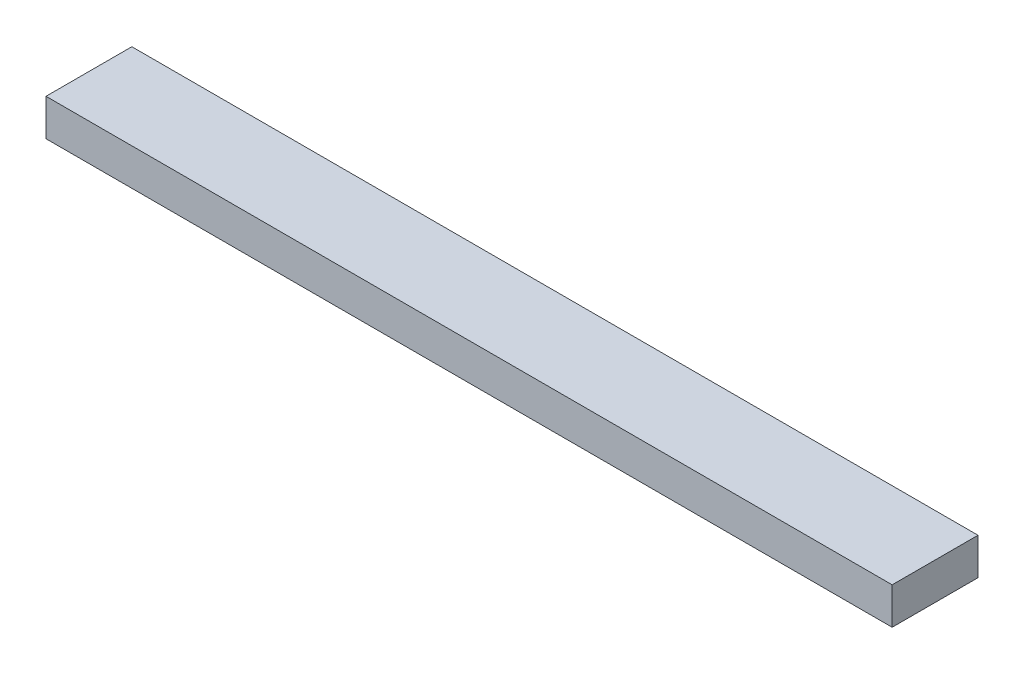
ISO-10303-21;
HEADER;
FILE_DESCRIPTION(('STEP AP214'),'2;1');
FILE_NAME('part.step','',(''),(''),'','','');
FILE_SCHEMA(('AUTOMOTIVE_DESIGN { 1 0 10303 214 1 1 1 1 }'));
ENDSEC;
DATA;
#1=APPLICATION_CONTEXT('core data for automotive mechanical design processes');
#2=APPLICATION_PROTOCOL_DEFINITION('international standard','automotive_design',2000,#1);
#3=PRODUCT_CONTEXT('',#1,'mechanical');
#4=PRODUCT('Part','Part','',(#3));
#5=PRODUCT_RELATED_PRODUCT_CATEGORY('part','',(#4));
#6=PRODUCT_DEFINITION_FORMATION('','',#4);
#7=PRODUCT_DEFINITION_CONTEXT('part definition',#1,'design');
#8=PRODUCT_DEFINITION('design','',#6,#7);
#9=PRODUCT_DEFINITION_SHAPE('','',#8);
#10=(LENGTH_UNIT() NAMED_UNIT(*) SI_UNIT(.MILLI.,.METRE.));
#11=(NAMED_UNIT(*) PLANE_ANGLE_UNIT() SI_UNIT($,.RADIAN.));
#12=(NAMED_UNIT(*) SI_UNIT($,.STERADIAN.) SOLID_ANGLE_UNIT());
#13=UNCERTAINTY_MEASURE_WITH_UNIT(LENGTH_MEASURE(1.E-05),#10,'distance_accuracy_value','');
#14=(GEOMETRIC_REPRESENTATION_CONTEXT(3) GLOBAL_UNCERTAINTY_ASSIGNED_CONTEXT((#13)) GLOBAL_UNIT_ASSIGNED_CONTEXT((#10,
#11,#12)) REPRESENTATION_CONTEXT('',''));
#15=CARTESIAN_POINT('',(0.,0.,0.));
#16=DIRECTION('',(0.,0.,1.));
#17=DIRECTION('',(1.,0.,0.));
#18=AXIS2_PLACEMENT_3D('',#15,#16,#17);
#19=CARTESIAN_POINT('',(0.,38.1,0.));
#20=DIRECTION('',(1.,0.,0.));
#21=DIRECTION('',(0.,0.,-1.));
#22=AXIS2_PLACEMENT_3D('',#19,#20,#21);
#23=PLANE('',#22);
#24=DIRECTION('',(0.,0.,1.));
#25=VECTOR('',#24,1.);
#26=CARTESIAN_POINT('',(0.,0.,0.));
#27=LINE('',#26,#25);
#28=CARTESIAN_POINT('',(0.,0.,-88.9));
#29=VERTEX_POINT('',#28);
#30=CARTESIAN_POINT('',(0.,0.,0.));
#31=VERTEX_POINT('',#30);
#32=EDGE_CURVE('E94',#29,#31,#27,.T.);
#33=ORIENTED_EDGE('',*,*,#32,.T.);
#34=DIRECTION('',(0.,-1.,0.));
#35=VECTOR('',#34,1.);
#36=CARTESIAN_POINT('',(0.,38.1,0.));
#37=LINE('',#36,#35);
#38=CARTESIAN_POINT('',(0.,38.1,0.));
#39=VERTEX_POINT('',#38);
#40=EDGE_CURVE('E11',#39,#31,#37,.T.);
#41=ORIENTED_EDGE('',*,*,#40,.F.);
#42=DIRECTION('',(0.,0.,1.));
#43=VECTOR('',#42,1.);
#44=CARTESIAN_POINT('',(0.,38.1,0.));
#45=LINE('',#44,#43);
#46=CARTESIAN_POINT('',(0.,38.1,-88.9));
#47=VERTEX_POINT('',#46);
#48=EDGE_CURVE('E82',#47,#39,#45,.T.);
#49=ORIENTED_EDGE('',*,*,#48,.F.);
#50=DIRECTION('',(0.,-1.,0.));
#51=VECTOR('',#50,1.);
#52=CARTESIAN_POINT('',(0.,38.1,-88.9));
#53=LINE('',#52,#51);
#54=EDGE_CURVE('E90',#47,#29,#53,.T.);
#55=ORIENTED_EDGE('',*,*,#54,.T.);
#56=EDGE_LOOP('',(#33,#41,#49,#55));
#57=FACE_BOUND('',#56,.T.);
#58=ADVANCED_FACE('F31',(#57),#23,.F.);
#59=CARTESIAN_POINT('',(0.,38.1,0.));
#60=DIRECTION('',(0.,0.,-1.));
#61=DIRECTION('',(-1.,0.,0.));
#62=AXIS2_PLACEMENT_3D('',#59,#60,#61);
#63=PLANE('',#62);
#64=DIRECTION('',(1.,0.,0.));
#65=VECTOR('',#64,1.);
#66=CARTESIAN_POINT('',(0.,0.,0.));
#67=LINE('',#66,#65);
#68=CARTESIAN_POINT('',(876.3,0.,0.));
#69=VERTEX_POINT('',#68);
#70=EDGE_CURVE('E86',#31,#69,#67,.T.);
#71=ORIENTED_EDGE('',*,*,#70,.T.);
#72=DIRECTION('',(0.,-1.,0.));
#73=VECTOR('',#72,1.);
#74=CARTESIAN_POINT('',(876.3,38.1,0.));
#75=LINE('',#74,#73);
#76=CARTESIAN_POINT('',(876.3,38.1,0.));
#77=VERTEX_POINT('',#76);
#78=EDGE_CURVE('E39',#77,#69,#75,.T.);
#79=ORIENTED_EDGE('',*,*,#78,.F.);
#80=DIRECTION('',(1.,0.,0.));
#81=VECTOR('',#80,1.);
#82=CARTESIAN_POINT('',(0.,38.1,0.));
#83=LINE('',#82,#81);
#84=EDGE_CURVE('E77',#39,#77,#83,.T.);
#85=ORIENTED_EDGE('',*,*,#84,.F.);
#86=ORIENTED_EDGE('',*,*,#40,.T.);
#87=EDGE_LOOP('',(#71,#79,#85,#86));
#88=FACE_BOUND('',#87,.T.);
#89=ADVANCED_FACE('F85',(#88),#63,.F.);
#90=CARTESIAN_POINT('',(876.3,38.1,0.));
#91=DIRECTION('',(-1.,0.,0.));
#92=DIRECTION('',(0.,0.,1.));
#93=AXIS2_PLACEMENT_3D('',#90,#91,#92);
#94=PLANE('',#93);
#95=DIRECTION('',(0.,0.,-1.));
#96=VECTOR('',#95,1.);
#97=CARTESIAN_POINT('',(876.3,0.,0.));
#98=LINE('',#97,#96);
#99=CARTESIAN_POINT('',(876.3,0.,-88.9));
#100=VERTEX_POINT('',#99);
#101=EDGE_CURVE('E64',#69,#100,#98,.T.);
#102=ORIENTED_EDGE('',*,*,#101,.T.);
#103=DIRECTION('',(0.,-1.,0.));
#104=VECTOR('',#103,1.);
#105=CARTESIAN_POINT('',(876.3,38.1,-88.9));
#106=LINE('',#105,#104);
#107=CARTESIAN_POINT('',(876.3,38.1,-88.9));
#108=VERTEX_POINT('',#107);
#109=EDGE_CURVE('E87',#108,#100,#106,.T.);
#110=ORIENTED_EDGE('',*,*,#109,.F.);
#111=DIRECTION('',(0.,0.,-1.));
#112=VECTOR('',#111,1.);
#113=CARTESIAN_POINT('',(876.3,38.1,0.));
#114=LINE('',#113,#112);
#115=EDGE_CURVE('E80',#77,#108,#114,.T.);
#116=ORIENTED_EDGE('',*,*,#115,.F.);
#117=ORIENTED_EDGE('',*,*,#78,.T.);
#118=EDGE_LOOP('',(#102,#110,#116,#117));
#119=FACE_BOUND('',#118,.T.);
#120=ADVANCED_FACE('F88',(#119),#94,.F.);
#121=CARTESIAN_POINT('',(0.,38.1,-88.9));
#122=DIRECTION('',(0.,0.,1.));
#123=DIRECTION('',(1.,0.,0.));
#124=AXIS2_PLACEMENT_3D('',#121,#122,#123);
#125=PLANE('',#124);
#126=DIRECTION('',(-1.,0.,0.));
#127=VECTOR('',#126,1.);
#128=CARTESIAN_POINT('',(0.,0.,-88.9));
#129=LINE('',#128,#127);
#130=EDGE_CURVE('E70',#100,#29,#129,.T.);
#131=ORIENTED_EDGE('',*,*,#130,.T.);
#132=ORIENTED_EDGE('',*,*,#54,.F.);
#133=DIRECTION('',(-1.,0.,0.));
#134=VECTOR('',#133,1.);
#135=CARTESIAN_POINT('',(0.,38.1,-88.9));
#136=LINE('',#135,#134);
#137=EDGE_CURVE('E47',#108,#47,#136,.T.);
#138=ORIENTED_EDGE('',*,*,#137,.F.);
#139=ORIENTED_EDGE('',*,*,#109,.T.);
#140=EDGE_LOOP('',(#131,#132,#138,#139));
#141=FACE_BOUND('',#140,.T.);
#142=ADVANCED_FACE('F101',(#141),#125,.F.);
#143=CARTESIAN_POINT('',(0.,38.1,-88.9));
#144=DIRECTION('',(0.,-1.,0.));
#145=DIRECTION('',(0.,0.,-1.));
#146=AXIS2_PLACEMENT_3D('',#143,#144,#145);
#147=PLANE('',#146);
#148=ORIENTED_EDGE('',*,*,#48,.T.);
#149=ORIENTED_EDGE('',*,*,#84,.T.);
#150=ORIENTED_EDGE('',*,*,#115,.T.);
#151=ORIENTED_EDGE('',*,*,#137,.T.);
#152=EDGE_LOOP('',(#148,#149,#150,#151));
#153=FACE_BOUND('',#152,.T.);
#154=ADVANCED_FACE('F78',(#153),#147,.F.);
#155=CARTESIAN_POINT('',(0.,0.,-88.9));
#156=DIRECTION('',(0.,-1.,0.));
#157=DIRECTION('',(0.,0.,-1.));
#158=AXIS2_PLACEMENT_3D('',#155,#156,#157);
#159=PLANE('',#158);
#160=ORIENTED_EDGE('',*,*,#32,.F.);
#161=ORIENTED_EDGE('',*,*,#130,.F.);
#162=ORIENTED_EDGE('',*,*,#101,.F.);
#163=ORIENTED_EDGE('',*,*,#70,.F.);
#164=EDGE_LOOP('',(#160,#161,#162,#163));
#165=FACE_BOUND('',#164,.T.);
#166=ADVANCED_FACE('F104',(#165),#159,.T.);
#167=CLOSED_SHELL('',(#58,#89,#120,#142,#154,#166));
#168=MANIFOLD_SOLID_BREP('B2',#167);
#169=ADVANCED_BREP_SHAPE_REPRESENTATION('',(#18,#168),#14);
#170=SHAPE_DEFINITION_REPRESENTATION(#9,#169);
ENDSEC;
END-ISO-10303-21;
